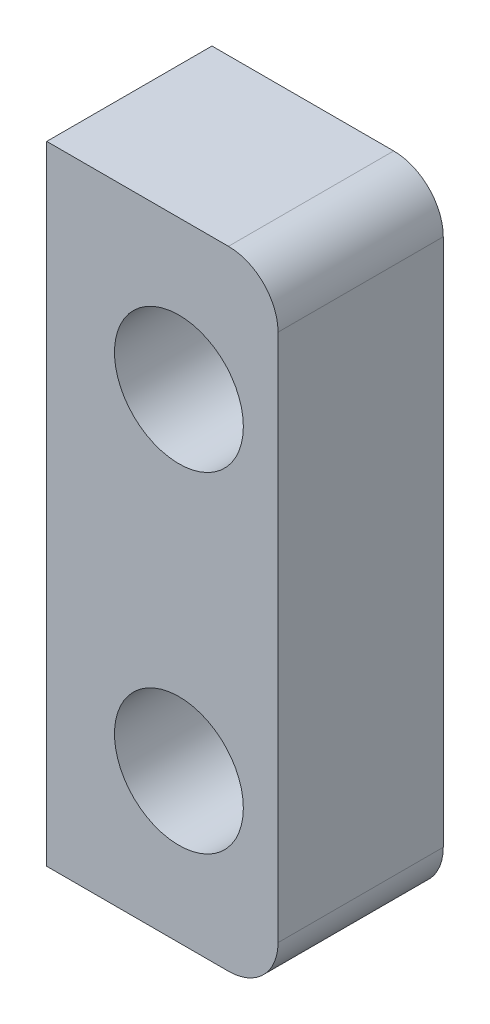
ISO-10303-21;
HEADER;
FILE_DESCRIPTION(('STEP AP214'),'2;1');
FILE_NAME('part.step','',(''),(''),'','','');
FILE_SCHEMA(('AUTOMOTIVE_DESIGN { 1 0 10303 214 1 1 1 1 }'));
ENDSEC;
DATA;
#1=APPLICATION_CONTEXT('core data for automotive mechanical design processes');
#2=APPLICATION_PROTOCOL_DEFINITION('international standard','automotive_design',2000,#1);
#3=PRODUCT_CONTEXT('',#1,'mechanical');
#4=PRODUCT('Part','Part','',(#3));
#5=PRODUCT_RELATED_PRODUCT_CATEGORY('part','',(#4));
#6=PRODUCT_DEFINITION_FORMATION('','',#4);
#7=PRODUCT_DEFINITION_CONTEXT('part definition',#1,'design');
#8=PRODUCT_DEFINITION('design','',#6,#7);
#9=PRODUCT_DEFINITION_SHAPE('','',#8);
#10=(LENGTH_UNIT() NAMED_UNIT(*) SI_UNIT(.MILLI.,.METRE.));
#11=(NAMED_UNIT(*) PLANE_ANGLE_UNIT() SI_UNIT($,.RADIAN.));
#12=(NAMED_UNIT(*) SI_UNIT($,.STERADIAN.) SOLID_ANGLE_UNIT());
#13=UNCERTAINTY_MEASURE_WITH_UNIT(LENGTH_MEASURE(1.E-05),#10,'distance_accuracy_value','');
#14=(GEOMETRIC_REPRESENTATION_CONTEXT(3) GLOBAL_UNCERTAINTY_ASSIGNED_CONTEXT((#13)) GLOBAL_UNIT_ASSIGNED_CONTEXT((#10,
#11,#12)) REPRESENTATION_CONTEXT('',''));
#15=CARTESIAN_POINT('',(0.,0.,0.));
#16=DIRECTION('',(0.,0.,1.));
#17=DIRECTION('',(1.,0.,0.));
#18=AXIS2_PLACEMENT_3D('',#15,#16,#17);
#19=CARTESIAN_POINT('',(20.,-9.49999999999999,-5.));
#20=DIRECTION('',(0.,-1.,0.));
#21=DIRECTION('',(0.,0.,-1.));
#22=AXIS2_PLACEMENT_3D('',#19,#20,#21);
#23=PLANE('',#22);
#24=DIRECTION('',(1.,0.,0.));
#25=VECTOR('',#24,1.);
#26=CARTESIAN_POINT('',(20.,-9.49999999999999,0.));
#27=LINE('',#26,#25);
#28=CARTESIAN_POINT('',(20.,-9.49999999999999,0.));
#29=VERTEX_POINT('',#28);
#30=CARTESIAN_POINT('',(25.5,-9.49999999999999,0.));
#31=VERTEX_POINT('',#30);
#32=EDGE_CURVE('E118',#29,#31,#27,.T.);
#33=ORIENTED_EDGE('',*,*,#32,.F.);
#34=DIRECTION('',(0.,0.,1.));
#35=VECTOR('',#34,1.);
#36=CARTESIAN_POINT('',(20.,-9.49999999999999,-5.));
#37=LINE('',#36,#35);
#38=CARTESIAN_POINT('',(20.,-9.49999999999999,-5.));
#39=VERTEX_POINT('',#38);
#40=EDGE_CURVE('E11',#39,#29,#37,.T.);
#41=ORIENTED_EDGE('',*,*,#40,.F.);
#42=DIRECTION('',(1.,0.,0.));
#43=VECTOR('',#42,1.);
#44=CARTESIAN_POINT('',(20.,-9.49999999999999,-5.));
#45=LINE('',#44,#43);
#46=CARTESIAN_POINT('',(25.5,-9.49999999999999,-5.));
#47=VERTEX_POINT('',#46);
#48=EDGE_CURVE('E133',#39,#47,#45,.T.);
#49=ORIENTED_EDGE('',*,*,#48,.T.);
#50=DIRECTION('',(0.,0.,1.));
#51=VECTOR('',#50,1.);
#52=CARTESIAN_POINT('',(25.5,-9.49999999999999,-5.));
#53=LINE('',#52,#51);
#54=EDGE_CURVE('E36',#47,#31,#53,.T.);
#55=ORIENTED_EDGE('',*,*,#54,.T.);
#56=EDGE_LOOP('',(#33,#41,#49,#55));
#57=FACE_BOUND('',#56,.T.);
#58=ADVANCED_FACE('F33',(#57),#23,.T.);
#59=CARTESIAN_POINT('',(20.,-9.49999999999999,-5.));
#60=DIRECTION('',(-1.,0.,0.));
#61=DIRECTION('',(0.,0.,1.));
#62=AXIS2_PLACEMENT_3D('',#59,#60,#61);
#63=PLANE('',#62);
#64=DIRECTION('',(0.,-1.,0.));
#65=VECTOR('',#64,1.);
#66=CARTESIAN_POINT('',(20.,-9.49999999999999,0.));
#67=LINE('',#66,#65);
#68=CARTESIAN_POINT('',(20.,9.5,0.));
#69=VERTEX_POINT('',#68);
#70=EDGE_CURVE('E131',#69,#29,#67,.T.);
#71=ORIENTED_EDGE('',*,*,#70,.F.);
#72=DIRECTION('',(0.,0.,1.));
#73=VECTOR('',#72,1.);
#74=CARTESIAN_POINT('',(20.,9.5,-5.));
#75=LINE('',#74,#73);
#76=CARTESIAN_POINT('',(20.,9.5,-5.));
#77=VERTEX_POINT('',#76);
#78=EDGE_CURVE('E42',#77,#69,#75,.T.);
#79=ORIENTED_EDGE('',*,*,#78,.F.);
#80=DIRECTION('',(0.,-1.,0.));
#81=VECTOR('',#80,1.);
#82=CARTESIAN_POINT('',(20.,-9.49999999999999,-5.));
#83=LINE('',#82,#81);
#84=EDGE_CURVE('E108',#77,#39,#83,.T.);
#85=ORIENTED_EDGE('',*,*,#84,.T.);
#86=ORIENTED_EDGE('',*,*,#40,.T.);
#87=EDGE_LOOP('',(#71,#79,#85,#86));
#88=FACE_BOUND('',#87,.T.);
#89=ADVANCED_FACE('F141',(#88),#63,.T.);
#90=CARTESIAN_POINT('',(20.,9.5,-5.));
#91=DIRECTION('',(0.,1.,0.));
#92=DIRECTION('',(0.,0.,1.));
#93=AXIS2_PLACEMENT_3D('',#90,#91,#92);
#94=PLANE('',#93);
#95=DIRECTION('',(-1.,0.,0.));
#96=VECTOR('',#95,1.);
#97=CARTESIAN_POINT('',(20.,9.5,0.));
#98=LINE('',#97,#96);
#99=CARTESIAN_POINT('',(25.5,9.5,0.));
#100=VERTEX_POINT('',#99);
#101=EDGE_CURVE('E95',#100,#69,#98,.T.);
#102=ORIENTED_EDGE('',*,*,#101,.F.);
#103=DIRECTION('',(0.,0.,1.));
#104=VECTOR('',#103,1.);
#105=CARTESIAN_POINT('',(25.5,9.5,-5.));
#106=LINE('',#105,#104);
#107=CARTESIAN_POINT('',(25.5,9.5,-5.));
#108=VERTEX_POINT('',#107);
#109=EDGE_CURVE('E90',#108,#100,#106,.T.);
#110=ORIENTED_EDGE('',*,*,#109,.F.);
#111=DIRECTION('',(-1.,0.,0.));
#112=VECTOR('',#111,1.);
#113=CARTESIAN_POINT('',(20.,9.5,-5.));
#114=LINE('',#113,#112);
#115=EDGE_CURVE('E93',#108,#77,#114,.T.);
#116=ORIENTED_EDGE('',*,*,#115,.T.);
#117=ORIENTED_EDGE('',*,*,#78,.T.);
#118=EDGE_LOOP('',(#102,#110,#116,#117));
#119=FACE_BOUND('',#118,.T.);
#120=ADVANCED_FACE('F92',(#119),#94,.T.);
#121=CARTESIAN_POINT('',(25.5,8.,-5.));
#122=DIRECTION('',(0.,0.,1.));
#123=DIRECTION('',(1.,0.,0.));
#124=AXIS2_PLACEMENT_3D('',#121,#122,#123);
#125=CYLINDRICAL_SURFACE('',#124,1.5);
#126=CARTESIAN_POINT('',(25.5,8.,0.));
#127=DIRECTION('',(0.,0.,1.));
#128=DIRECTION('',(-1.,0.,0.));
#129=AXIS2_PLACEMENT_3D('',#126,#127,#128);
#130=CIRCLE('',#129,1.5);
#131=CARTESIAN_POINT('',(27.,7.99999999999999,0.));
#132=VERTEX_POINT('',#131);
#133=EDGE_CURVE('E128',#132,#100,#130,.T.);
#134=ORIENTED_EDGE('',*,*,#133,.F.);
#135=DIRECTION('',(0.,0.,1.));
#136=VECTOR('',#135,1.);
#137=CARTESIAN_POINT('',(27.,7.99999999999999,-5.));
#138=LINE('',#137,#136);
#139=CARTESIAN_POINT('',(27.,7.99999999999999,-5.));
#140=VERTEX_POINT('',#139);
#141=EDGE_CURVE('E100',#140,#132,#138,.T.);
#142=ORIENTED_EDGE('',*,*,#141,.F.);
#143=CARTESIAN_POINT('',(25.5,8.,-5.));
#144=DIRECTION('',(0.,0.,1.));
#145=DIRECTION('',(-1.,0.,0.));
#146=AXIS2_PLACEMENT_3D('',#143,#144,#145);
#147=CIRCLE('',#146,1.5);
#148=EDGE_CURVE('E106',#140,#108,#147,.T.);
#149=ORIENTED_EDGE('',*,*,#148,.T.);
#150=ORIENTED_EDGE('',*,*,#109,.T.);
#151=EDGE_LOOP('',(#134,#142,#149,#150));
#152=FACE_BOUND('',#151,.T.);
#153=ADVANCED_FACE('F110',(#152),#125,.T.);
#154=CARTESIAN_POINT('',(27.,-7.99999999999998,-5.));
#155=DIRECTION('',(1.,0.,0.));
#156=DIRECTION('',(0.,0.,-1.));
#157=AXIS2_PLACEMENT_3D('',#154,#155,#156);
#158=PLANE('',#157);
#159=DIRECTION('',(0.,1.,0.));
#160=VECTOR('',#159,1.);
#161=CARTESIAN_POINT('',(27.,-7.99999999999998,0.));
#162=LINE('',#161,#160);
#163=CARTESIAN_POINT('',(27.,-7.99999999999998,0.));
#164=VERTEX_POINT('',#163);
#165=EDGE_CURVE('E125',#164,#132,#162,.T.);
#166=ORIENTED_EDGE('',*,*,#165,.F.);
#167=DIRECTION('',(0.,0.,1.));
#168=VECTOR('',#167,1.);
#169=CARTESIAN_POINT('',(27.,-7.99999999999998,-5.));
#170=LINE('',#169,#168);
#171=CARTESIAN_POINT('',(27.,-7.99999999999998,-5.));
#172=VERTEX_POINT('',#171);
#173=EDGE_CURVE('E136',#172,#164,#170,.T.);
#174=ORIENTED_EDGE('',*,*,#173,.F.);
#175=DIRECTION('',(0.,1.,0.));
#176=VECTOR('',#175,1.);
#177=CARTESIAN_POINT('',(27.,-7.99999999999998,-5.));
#178=LINE('',#177,#176);
#179=EDGE_CURVE('E111',#172,#140,#178,.T.);
#180=ORIENTED_EDGE('',*,*,#179,.T.);
#181=ORIENTED_EDGE('',*,*,#141,.T.);
#182=EDGE_LOOP('',(#166,#174,#180,#181));
#183=FACE_BOUND('',#182,.T.);
#184=ADVANCED_FACE('F154',(#183),#158,.T.);
#185=CARTESIAN_POINT('',(25.5,-7.99999999999999,-5.));
#186=DIRECTION('',(0.,0.,1.));
#187=DIRECTION('',(1.,0.,0.));
#188=AXIS2_PLACEMENT_3D('',#185,#186,#187);
#189=CYLINDRICAL_SURFACE('',#188,1.5);
#190=CARTESIAN_POINT('',(25.5,-7.99999999999999,0.));
#191=DIRECTION('',(0.,0.,1.));
#192=DIRECTION('',(1.,0.,0.));
#193=AXIS2_PLACEMENT_3D('',#190,#191,#192);
#194=CIRCLE('',#193,1.5);
#195=EDGE_CURVE('E121',#31,#164,#194,.T.);
#196=ORIENTED_EDGE('',*,*,#195,.F.);
#197=ORIENTED_EDGE('',*,*,#54,.F.);
#198=CARTESIAN_POINT('',(25.5,-7.99999999999999,-5.));
#199=DIRECTION('',(0.,0.,1.));
#200=DIRECTION('',(1.,0.,0.));
#201=AXIS2_PLACEMENT_3D('',#198,#199,#200);
#202=CIRCLE('',#201,1.5);
#203=EDGE_CURVE('E113',#47,#172,#202,.T.);
#204=ORIENTED_EDGE('',*,*,#203,.T.);
#205=ORIENTED_EDGE('',*,*,#173,.T.);
#206=EDGE_LOOP('',(#196,#197,#204,#205));
#207=FACE_BOUND('',#206,.T.);
#208=ADVANCED_FACE('F138',(#207),#189,.T.);
#209=CARTESIAN_POINT('',(25.5,-7.99999999999999,-5.));
#210=DIRECTION('',(0.,0.,1.));
#211=DIRECTION('',(1.,0.,0.));
#212=AXIS2_PLACEMENT_3D('',#209,#210,#211);
#213=PLANE('',#212);
#214=CARTESIAN_POINT('',(24.,5.,-5.));
#215=DIRECTION('',(0.,0.,1.));
#216=DIRECTION('',(1.,0.,0.));
#217=AXIS2_PLACEMENT_3D('',#214,#215,#216);
#218=CIRCLE('',#217,1.95);
#219=CARTESIAN_POINT('',(25.95,5.,-5.));
#220=VERTEX_POINT('',#219);
#221=EDGE_CURVE('E180',#220,#220,#218,.T.);
#222=ORIENTED_EDGE('',*,*,#221,.T.);
#223=EDGE_LOOP('',(#222));
#224=FACE_BOUND('',#223,.T.);
#225=CARTESIAN_POINT('',(24.,-5.,-5.));
#226=DIRECTION('',(0.,0.,1.));
#227=DIRECTION('',(1.,0.,0.));
#228=AXIS2_PLACEMENT_3D('',#225,#226,#227);
#229=CIRCLE('',#228,1.95);
#230=CARTESIAN_POINT('',(25.95,-5.,-5.));
#231=VERTEX_POINT('',#230);
#232=EDGE_CURVE('E122',#231,#231,#229,.T.);
#233=ORIENTED_EDGE('',*,*,#232,.T.);
#234=EDGE_LOOP('',(#233));
#235=FACE_BOUND('',#234,.T.);
#236=ORIENTED_EDGE('',*,*,#48,.F.);
#237=ORIENTED_EDGE('',*,*,#84,.F.);
#238=ORIENTED_EDGE('',*,*,#115,.F.);
#239=ORIENTED_EDGE('',*,*,#148,.F.);
#240=ORIENTED_EDGE('',*,*,#179,.F.);
#241=ORIENTED_EDGE('',*,*,#203,.F.);
#242=EDGE_LOOP('',(#236,#237,#238,#239,#240,#241));
#243=FACE_BOUND('',#242,.T.);
#244=ADVANCED_FACE('F104',(#224,#235,#243),#213,.F.);
#245=CARTESIAN_POINT('',(25.5,-7.99999999999999,0.));
#246=DIRECTION('',(0.,0.,1.));
#247=DIRECTION('',(1.,0.,0.));
#248=AXIS2_PLACEMENT_3D('',#245,#246,#247);
#249=PLANE('',#248);
#250=CARTESIAN_POINT('',(24.,5.,0.));
#251=DIRECTION('',(0.,0.,1.));
#252=DIRECTION('',(1.,0.,0.));
#253=AXIS2_PLACEMENT_3D('',#250,#251,#252);
#254=CIRCLE('',#253,1.95);
#255=CARTESIAN_POINT('',(25.95,5.,0.));
#256=VERTEX_POINT('',#255);
#257=EDGE_CURVE('E183',#256,#256,#254,.T.);
#258=ORIENTED_EDGE('',*,*,#257,.F.);
#259=EDGE_LOOP('',(#258));
#260=FACE_BOUND('',#259,.T.);
#261=CARTESIAN_POINT('',(24.,-5.,0.));
#262=DIRECTION('',(0.,0.,1.));
#263=DIRECTION('',(1.,0.,0.));
#264=AXIS2_PLACEMENT_3D('',#261,#262,#263);
#265=CIRCLE('',#264,1.95);
#266=CARTESIAN_POINT('',(25.95,-5.,0.));
#267=VERTEX_POINT('',#266);
#268=EDGE_CURVE('E185',#267,#267,#265,.T.);
#269=ORIENTED_EDGE('',*,*,#268,.F.);
#270=EDGE_LOOP('',(#269));
#271=FACE_BOUND('',#270,.T.);
#272=ORIENTED_EDGE('',*,*,#32,.T.);
#273=ORIENTED_EDGE('',*,*,#195,.T.);
#274=ORIENTED_EDGE('',*,*,#165,.T.);
#275=ORIENTED_EDGE('',*,*,#133,.T.);
#276=ORIENTED_EDGE('',*,*,#101,.T.);
#277=ORIENTED_EDGE('',*,*,#70,.T.);
#278=EDGE_LOOP('',(#272,#273,#274,#275,#276,#277));
#279=FACE_BOUND('',#278,.T.);
#280=ADVANCED_FACE('F140',(#260,#271,#279),#249,.T.);
#281=CARTESIAN_POINT('',(24.,-5.,-5.));
#282=DIRECTION('',(0.,0.,1.));
#283=DIRECTION('',(1.,0.,0.));
#284=AXIS2_PLACEMENT_3D('',#281,#282,#283);
#285=CYLINDRICAL_SURFACE('',#284,1.95);
#286=ORIENTED_EDGE('',*,*,#232,.F.);
#287=EDGE_LOOP('',(#286));
#288=FACE_BOUND('',#287,.T.);
#289=ORIENTED_EDGE('',*,*,#268,.T.);
#290=EDGE_LOOP('',(#289));
#291=FACE_BOUND('',#290,.T.);
#292=ADVANCED_FACE('F165',(#288,#291),#285,.F.);
#293=CARTESIAN_POINT('',(24.,5.,-5.));
#294=DIRECTION('',(0.,0.,1.));
#295=DIRECTION('',(1.,0.,0.));
#296=AXIS2_PLACEMENT_3D('',#293,#294,#295);
#297=CYLINDRICAL_SURFACE('',#296,1.95);
#298=ORIENTED_EDGE('',*,*,#221,.F.);
#299=EDGE_LOOP('',(#298));
#300=FACE_BOUND('',#299,.T.);
#301=ORIENTED_EDGE('',*,*,#257,.T.);
#302=EDGE_LOOP('',(#301));
#303=FACE_BOUND('',#302,.T.);
#304=ADVANCED_FACE('F172',(#300,#303),#297,.F.);
#305=CLOSED_SHELL('',(#58,#89,#120,#153,#184,#208,#244,#280,#292,#304));
#306=MANIFOLD_SOLID_BREP('B2',#305);
#307=ADVANCED_BREP_SHAPE_REPRESENTATION('',(#18,#306),#14);
#308=SHAPE_DEFINITION_REPRESENTATION(#9,#307);
ENDSEC;
END-ISO-10303-21;
